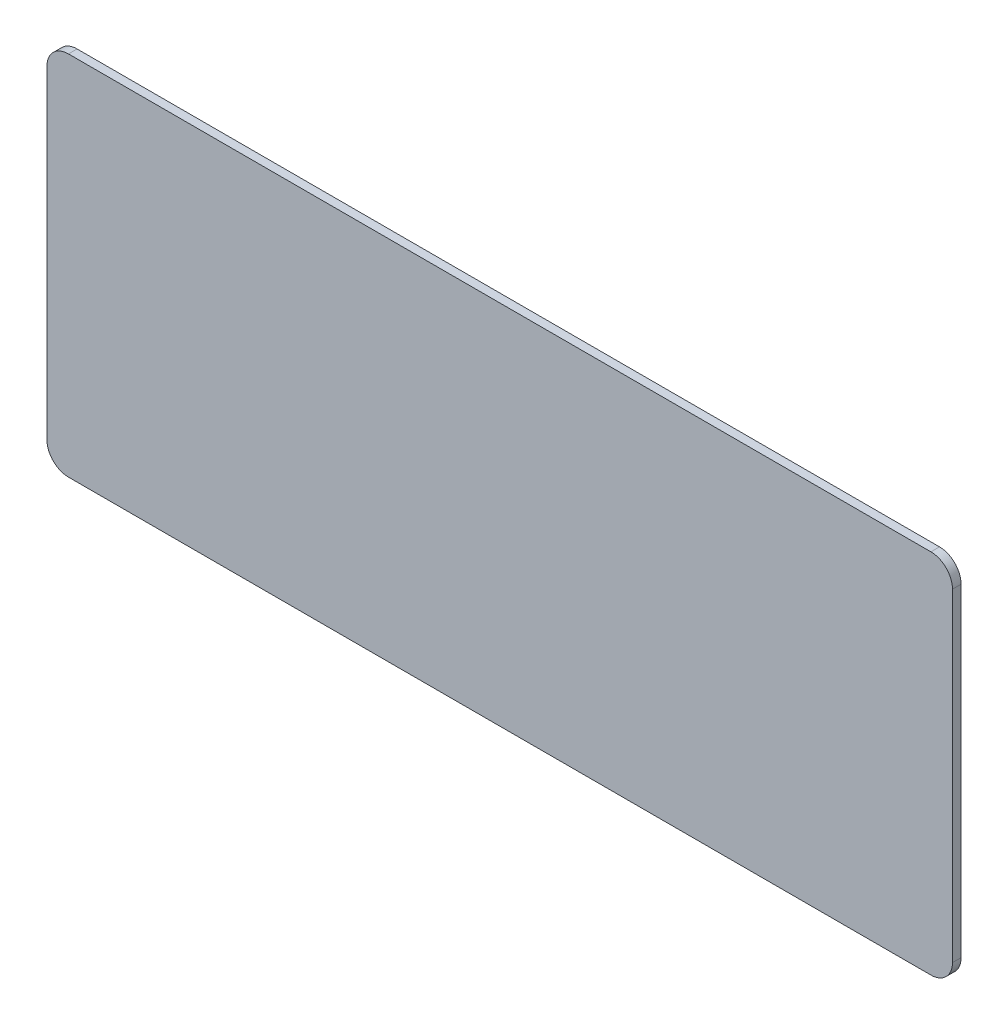
ISO-10303-21;
HEADER;
FILE_DESCRIPTION(('STEP AP214'),'2;1');
FILE_NAME('part.step','',(''),(''),'','','');
FILE_SCHEMA(('AUTOMOTIVE_DESIGN { 1 0 10303 214 1 1 1 1 }'));
ENDSEC;
DATA;
#1=APPLICATION_CONTEXT('core data for automotive mechanical design processes');
#2=APPLICATION_PROTOCOL_DEFINITION('international standard','automotive_design',2000,#1);
#3=PRODUCT_CONTEXT('',#1,'mechanical');
#4=PRODUCT('Part','Part','',(#3));
#5=PRODUCT_RELATED_PRODUCT_CATEGORY('part','',(#4));
#6=PRODUCT_DEFINITION_FORMATION('','',#4);
#7=PRODUCT_DEFINITION_CONTEXT('part definition',#1,'design');
#8=PRODUCT_DEFINITION('design','',#6,#7);
#9=PRODUCT_DEFINITION_SHAPE('','',#8);
#10=(LENGTH_UNIT() NAMED_UNIT(*) SI_UNIT(.MILLI.,.METRE.));
#11=(NAMED_UNIT(*) PLANE_ANGLE_UNIT() SI_UNIT($,.RADIAN.));
#12=(NAMED_UNIT(*) SI_UNIT($,.STERADIAN.) SOLID_ANGLE_UNIT());
#13=UNCERTAINTY_MEASURE_WITH_UNIT(LENGTH_MEASURE(1.E-05),#10,'distance_accuracy_value','');
#14=(GEOMETRIC_REPRESENTATION_CONTEXT(3) GLOBAL_UNCERTAINTY_ASSIGNED_CONTEXT((#13)) GLOBAL_UNIT_ASSIGNED_CONTEXT((#10,
#11,#12)) REPRESENTATION_CONTEXT('',''));
#15=CARTESIAN_POINT('',(0.,0.,0.));
#16=DIRECTION('',(0.,0.,1.));
#17=DIRECTION('',(1.,0.,0.));
#18=AXIS2_PLACEMENT_3D('',#15,#16,#17);
#19=CARTESIAN_POINT('',(0.,-1.38777878078145E-13,0.508000000000008));
#20=DIRECTION('',(1.,0.,0.));
#21=DIRECTION('',(0.,1.,0.));
#22=AXIS2_PLACEMENT_3D('',#19,#20,#21);
#23=PLANE('',#22);
#24=DIRECTION('',(0.,-1.,0.));
#25=VECTOR('',#24,1.);
#26=CARTESIAN_POINT('',(0.,-1.38777878078145E-13,0.508000000000008));
#27=LINE('',#26,#25);
#28=CARTESIAN_POINT('',(0.,20.32,0.508000000000008));
#29=VERTEX_POINT('',#28);
#30=CARTESIAN_POINT('',(0.,1.26999999999983,0.508000000000036));
#31=VERTEX_POINT('',#30);
#32=EDGE_CURVE('E140',#29,#31,#27,.T.);
#33=ORIENTED_EDGE('',*,*,#32,.F.);
#34=DIRECTION('',(0.,0.,-1.));
#35=VECTOR('',#34,1.);
#36=CARTESIAN_POINT('',(0.,20.32,0.508000000000008));
#37=LINE('',#36,#35);
#38=CARTESIAN_POINT('',(0.,20.32,0.));
#39=VERTEX_POINT('',#38);
#40=EDGE_CURVE('E124',#29,#39,#37,.T.);
#41=ORIENTED_EDGE('',*,*,#40,.T.);
#42=DIRECTION('',(0.,-1.,0.));
#43=VECTOR('',#42,1.);
#44=CARTESIAN_POINT('',(0.,-1.66533453693773E-13,0.));
#45=LINE('',#44,#43);
#46=CARTESIAN_POINT('',(0.,1.26999999999983,0.));
#47=VERTEX_POINT('',#46);
#48=EDGE_CURVE('E137',#39,#47,#45,.T.);
#49=ORIENTED_EDGE('',*,*,#48,.T.);
#50=DIRECTION('',(0.,0.,-1.));
#51=VECTOR('',#50,1.);
#52=CARTESIAN_POINT('',(0.,1.26999999999983,0.508000000000036));
#53=LINE('',#52,#51);
#54=EDGE_CURVE('E143',#47,#31,#53,.F.);
#55=ORIENTED_EDGE('',*,*,#54,.T.);
#56=EDGE_LOOP('',(#33,#41,#49,#55));
#57=FACE_BOUND('',#56,.T.);
#58=ADVANCED_FACE('F43',(#57),#23,.F.);
#59=CARTESIAN_POINT('',(0.,-1.38777878078145E-13,0.508000000000008));
#60=DIRECTION('',(0.,1.,0.));
#61=DIRECTION('',(0.,0.,1.));
#62=AXIS2_PLACEMENT_3D('',#59,#60,#61);
#63=PLANE('',#62);
#64=DIRECTION('',(1.,0.,0.));
#65=VECTOR('',#64,1.);
#66=CARTESIAN_POINT('',(0.,-1.66533453693773E-13,0.));
#67=LINE('',#66,#65);
#68=CARTESIAN_POINT('',(1.27,-1.66533453693773E-13,0.));
#69=VERTEX_POINT('',#68);
#70=CARTESIAN_POINT('',(52.07,-1.66533453693773E-13,0.));
#71=VERTEX_POINT('',#70);
#72=EDGE_CURVE('E148',#69,#71,#67,.T.);
#73=ORIENTED_EDGE('',*,*,#72,.T.);
#74=DIRECTION('',(0.,0.,-1.));
#75=VECTOR('',#74,1.);
#76=CARTESIAN_POINT('',(52.07,0.,0.507999999999995));
#77=LINE('',#76,#75);
#78=CARTESIAN_POINT('',(52.07,0.,0.507999999999995));
#79=VERTEX_POINT('',#78);
#80=EDGE_CURVE('E11',#71,#79,#77,.F.);
#81=ORIENTED_EDGE('',*,*,#80,.T.);
#82=DIRECTION('',(1.,0.,0.));
#83=VECTOR('',#82,1.);
#84=CARTESIAN_POINT('',(0.,-1.38777878078145E-13,0.508000000000008));
#85=LINE('',#84,#83);
#86=CARTESIAN_POINT('',(1.27,0.,0.508000000000008));
#87=VERTEX_POINT('',#86);
#88=EDGE_CURVE('E195',#87,#79,#85,.T.);
#89=ORIENTED_EDGE('',*,*,#88,.F.);
#90=DIRECTION('',(0.,0.,-1.));
#91=VECTOR('',#90,1.);
#92=CARTESIAN_POINT('',(1.27,0.,0.508000000000008));
#93=LINE('',#92,#91);
#94=EDGE_CURVE('E52',#87,#69,#93,.T.);
#95=ORIENTED_EDGE('',*,*,#94,.T.);
#96=EDGE_LOOP('',(#73,#81,#89,#95));
#97=FACE_BOUND('',#96,.T.);
#98=ADVANCED_FACE('F193',(#97),#63,.F.);
#99=CARTESIAN_POINT('',(53.34,0.,0.507999999999995));
#100=DIRECTION('',(-1.,0.,0.));
#101=DIRECTION('',(0.,0.,1.));
#102=AXIS2_PLACEMENT_3D('',#99,#100,#101);
#103=PLANE('',#102);
#104=DIRECTION('',(0.,1.,0.));
#105=VECTOR('',#104,1.);
#106=CARTESIAN_POINT('',(53.34,-1.66533453693773E-13,0.));
#107=LINE('',#106,#105);
#108=CARTESIAN_POINT('',(53.34,1.26999999999983,0.));
#109=VERTEX_POINT('',#108);
#110=CARTESIAN_POINT('',(53.34,20.32,0.));
#111=VERTEX_POINT('',#110);
#112=EDGE_CURVE('E154',#109,#111,#107,.T.);
#113=ORIENTED_EDGE('',*,*,#112,.T.);
#114=DIRECTION('',(0.,0.,-1.));
#115=VECTOR('',#114,1.);
#116=CARTESIAN_POINT('',(53.34,20.32,0.507999999999995));
#117=LINE('',#116,#115);
#118=CARTESIAN_POINT('',(53.34,20.32,0.507999999999995));
#119=VERTEX_POINT('',#118);
#120=EDGE_CURVE('E59',#111,#119,#117,.F.);
#121=ORIENTED_EDGE('',*,*,#120,.T.);
#122=DIRECTION('',(0.,1.,0.));
#123=VECTOR('',#122,1.);
#124=CARTESIAN_POINT('',(53.34,0.,0.507999999999995));
#125=LINE('',#124,#123);
#126=CARTESIAN_POINT('',(53.34,1.26999999999983,0.508000000000008));
#127=VERTEX_POINT('',#126);
#128=EDGE_CURVE('E203',#127,#119,#125,.T.);
#129=ORIENTED_EDGE('',*,*,#128,.F.);
#130=DIRECTION('',(0.,0.,-1.));
#131=VECTOR('',#130,1.);
#132=CARTESIAN_POINT('',(53.34,1.26999999999983,0.508000000000008));
#133=LINE('',#132,#131);
#134=EDGE_CURVE('E185',#127,#109,#133,.T.);
#135=ORIENTED_EDGE('',*,*,#134,.T.);
#136=EDGE_LOOP('',(#113,#121,#129,#135));
#137=FACE_BOUND('',#136,.T.);
#138=ADVANCED_FACE('F202',(#137),#103,.F.);
#139=CARTESIAN_POINT('',(0.,21.59,0.507999999999995));
#140=DIRECTION('',(0.,-1.,0.));
#141=DIRECTION('',(0.,0.,-1.));
#142=AXIS2_PLACEMENT_3D('',#139,#140,#141);
#143=PLANE('',#142);
#144=DIRECTION('',(-1.,0.,0.));
#145=VECTOR('',#144,1.);
#146=CARTESIAN_POINT('',(0.,21.59,0.));
#147=LINE('',#146,#145);
#148=CARTESIAN_POINT('',(52.07,21.59,0.));
#149=VERTEX_POINT('',#148);
#150=CARTESIAN_POINT('',(1.27000000000001,21.59,0.));
#151=VERTEX_POINT('',#150);
#152=EDGE_CURVE('E162',#149,#151,#147,.T.);
#153=ORIENTED_EDGE('',*,*,#152,.T.);
#154=DIRECTION('',(0.,0.,-1.));
#155=VECTOR('',#154,1.);
#156=CARTESIAN_POINT('',(1.27000000000001,21.59,0.507999999999995));
#157=LINE('',#156,#155);
#158=CARTESIAN_POINT('',(1.27000000000001,21.59,0.507999999999995));
#159=VERTEX_POINT('',#158);
#160=EDGE_CURVE('E125',#151,#159,#157,.F.);
#161=ORIENTED_EDGE('',*,*,#160,.T.);
#162=DIRECTION('',(-1.,0.,0.));
#163=VECTOR('',#162,1.);
#164=CARTESIAN_POINT('',(0.,21.59,0.507999999999995));
#165=LINE('',#164,#163);
#166=CARTESIAN_POINT('',(52.07,21.59,0.507999999999995));
#167=VERTEX_POINT('',#166);
#168=EDGE_CURVE('E157',#167,#159,#165,.T.);
#169=ORIENTED_EDGE('',*,*,#168,.F.);
#170=DIRECTION('',(0.,0.,-1.));
#171=VECTOR('',#170,1.);
#172=CARTESIAN_POINT('',(52.07,21.59,0.507999999999995));
#173=LINE('',#172,#171);
#174=EDGE_CURVE('E131',#167,#149,#173,.T.);
#175=ORIENTED_EDGE('',*,*,#174,.T.);
#176=EDGE_LOOP('',(#153,#161,#169,#175));
#177=FACE_BOUND('',#176,.T.);
#178=ADVANCED_FACE('F235',(#177),#143,.F.);
#179=CARTESIAN_POINT('',(0.,21.59,0.507999999999995));
#180=DIRECTION('',(0.,0.,-1.));
#181=DIRECTION('',(-1.,0.,0.));
#182=AXIS2_PLACEMENT_3D('',#179,#180,#181);
#183=PLANE('',#182);
#184=ORIENTED_EDGE('',*,*,#168,.T.);
#185=CARTESIAN_POINT('',(1.27000000000001,20.32,0.508000000000008));
#186=DIRECTION('',(0.,0.,-1.));
#187=DIRECTION('',(-1.,0.,0.));
#188=AXIS2_PLACEMENT_3D('',#185,#186,#187);
#189=CIRCLE('',#188,1.27);
#190=EDGE_CURVE('E183',#159,#29,#189,.F.);
#191=ORIENTED_EDGE('',*,*,#190,.T.);
#192=ORIENTED_EDGE('',*,*,#32,.T.);
#193=CARTESIAN_POINT('',(1.27,1.26999999999983,0.508000000000008));
#194=DIRECTION('',(0.,0.,-1.));
#195=DIRECTION('',(-1.,0.,0.));
#196=AXIS2_PLACEMENT_3D('',#193,#194,#195);
#197=CIRCLE('',#196,1.27);
#198=EDGE_CURVE('E176',#31,#87,#197,.F.);
#199=ORIENTED_EDGE('',*,*,#198,.T.);
#200=ORIENTED_EDGE('',*,*,#88,.T.);
#201=CARTESIAN_POINT('',(52.07,1.26999999999983,0.508000000000008));
#202=DIRECTION('',(0.,0.,-1.));
#203=DIRECTION('',(-1.,0.,0.));
#204=AXIS2_PLACEMENT_3D('',#201,#202,#203);
#205=CIRCLE('',#204,1.27);
#206=EDGE_CURVE('E66',#79,#127,#205,.F.);
#207=ORIENTED_EDGE('',*,*,#206,.T.);
#208=ORIENTED_EDGE('',*,*,#128,.T.);
#209=CARTESIAN_POINT('',(52.07,20.32,0.507999999999995));
#210=DIRECTION('',(0.,0.,-1.));
#211=DIRECTION('',(-1.,0.,0.));
#212=AXIS2_PLACEMENT_3D('',#209,#210,#211);
#213=CIRCLE('',#212,1.27);
#214=EDGE_CURVE('E181',#119,#167,#213,.F.);
#215=ORIENTED_EDGE('',*,*,#214,.T.);
#216=EDGE_LOOP('',(#184,#191,#192,#199,#200,#207,#208,#215));
#217=FACE_BOUND('',#216,.T.);
#218=ADVANCED_FACE('F212',(#217),#183,.F.);
#219=CARTESIAN_POINT('',(0.,21.59,0.));
#220=DIRECTION('',(0.,0.,-1.));
#221=DIRECTION('',(-1.,0.,0.));
#222=AXIS2_PLACEMENT_3D('',#219,#220,#221);
#223=PLANE('',#222);
#224=ORIENTED_EDGE('',*,*,#48,.F.);
#225=CARTESIAN_POINT('',(1.27000000000001,20.32,0.));
#226=DIRECTION('',(0.,0.,-1.));
#227=DIRECTION('',(-1.,0.,0.));
#228=AXIS2_PLACEMENT_3D('',#225,#226,#227);
#229=CIRCLE('',#228,1.27);
#230=EDGE_CURVE('E120',#39,#151,#229,.T.);
#231=ORIENTED_EDGE('',*,*,#230,.T.);
#232=ORIENTED_EDGE('',*,*,#152,.F.);
#233=CARTESIAN_POINT('',(52.07,20.32,0.));
#234=DIRECTION('',(0.,0.,-1.));
#235=DIRECTION('',(-1.,0.,0.));
#236=AXIS2_PLACEMENT_3D('',#233,#234,#235);
#237=CIRCLE('',#236,1.27);
#238=EDGE_CURVE('E132',#149,#111,#237,.T.);
#239=ORIENTED_EDGE('',*,*,#238,.T.);
#240=ORIENTED_EDGE('',*,*,#112,.F.);
#241=CARTESIAN_POINT('',(52.07,1.26999999999983,0.));
#242=DIRECTION('',(0.,0.,-1.));
#243=DIRECTION('',(-1.,0.,0.));
#244=AXIS2_PLACEMENT_3D('',#241,#242,#243);
#245=CIRCLE('',#244,1.27);
#246=EDGE_CURVE('E168',#109,#71,#245,.T.);
#247=ORIENTED_EDGE('',*,*,#246,.T.);
#248=ORIENTED_EDGE('',*,*,#72,.F.);
#249=CARTESIAN_POINT('',(1.27,1.26999999999983,0.));
#250=DIRECTION('',(0.,0.,-1.));
#251=DIRECTION('',(-1.,0.,0.));
#252=AXIS2_PLACEMENT_3D('',#249,#250,#251);
#253=CIRCLE('',#252,1.27);
#254=EDGE_CURVE('E142',#69,#47,#253,.T.);
#255=ORIENTED_EDGE('',*,*,#254,.T.);
#256=EDGE_LOOP('',(#224,#231,#232,#239,#240,#247,#248,#255));
#257=FACE_BOUND('',#256,.T.);
#258=ADVANCED_FACE('F145',(#257),#223,.T.);
#259=CARTESIAN_POINT('',(1.27000000000001,20.32,0.508000000000008));
#260=DIRECTION('',(0.,0.,-1.));
#261=DIRECTION('',(-1.,0.,0.));
#262=AXIS2_PLACEMENT_3D('',#259,#260,#261);
#263=CYLINDRICAL_SURFACE('',#262,1.27);
#264=ORIENTED_EDGE('',*,*,#190,.F.);
#265=ORIENTED_EDGE('',*,*,#160,.F.);
#266=ORIENTED_EDGE('',*,*,#230,.F.);
#267=ORIENTED_EDGE('',*,*,#40,.F.);
#268=EDGE_LOOP('',(#264,#265,#266,#267));
#269=FACE_BOUND('',#268,.T.);
#270=ADVANCED_FACE('F123',(#269),#263,.T.);
#271=CARTESIAN_POINT('',(52.07,20.32,0.507999999999995));
#272=DIRECTION('',(0.,0.,-1.));
#273=DIRECTION('',(-1.,0.,0.));
#274=AXIS2_PLACEMENT_3D('',#271,#272,#273);
#275=CYLINDRICAL_SURFACE('',#274,1.27);
#276=ORIENTED_EDGE('',*,*,#214,.F.);
#277=ORIENTED_EDGE('',*,*,#120,.F.);
#278=ORIENTED_EDGE('',*,*,#238,.F.);
#279=ORIENTED_EDGE('',*,*,#174,.F.);
#280=EDGE_LOOP('',(#276,#277,#278,#279));
#281=FACE_BOUND('',#280,.T.);
#282=ADVANCED_FACE('F217',(#281),#275,.T.);
#283=CARTESIAN_POINT('',(52.07,1.26999999999983,0.508000000000008));
#284=DIRECTION('',(0.,0.,-1.));
#285=DIRECTION('',(-1.,0.,0.));
#286=AXIS2_PLACEMENT_3D('',#283,#284,#285);
#287=CYLINDRICAL_SURFACE('',#286,1.27);
#288=ORIENTED_EDGE('',*,*,#206,.F.);
#289=ORIENTED_EDGE('',*,*,#80,.F.);
#290=ORIENTED_EDGE('',*,*,#246,.F.);
#291=ORIENTED_EDGE('',*,*,#134,.F.);
#292=EDGE_LOOP('',(#288,#289,#290,#291));
#293=FACE_BOUND('',#292,.T.);
#294=ADVANCED_FACE('F201',(#293),#287,.T.);
#295=CARTESIAN_POINT('',(1.27,1.26999999999983,0.508000000000008));
#296=DIRECTION('',(0.,0.,-1.));
#297=DIRECTION('',(-1.,0.,0.));
#298=AXIS2_PLACEMENT_3D('',#295,#296,#297);
#299=CYLINDRICAL_SURFACE('',#298,1.27);
#300=ORIENTED_EDGE('',*,*,#198,.F.);
#301=ORIENTED_EDGE('',*,*,#54,.F.);
#302=ORIENTED_EDGE('',*,*,#254,.F.);
#303=ORIENTED_EDGE('',*,*,#94,.F.);
#304=EDGE_LOOP('',(#300,#301,#302,#303));
#305=FACE_BOUND('',#304,.T.);
#306=ADVANCED_FACE('F45',(#305),#299,.T.);
#307=CLOSED_SHELL('',(#58,#98,#138,#178,#218,#258,#270,#282,#294,#306));
#308=MANIFOLD_SOLID_BREP('B2',#307);
#309=ADVANCED_BREP_SHAPE_REPRESENTATION('',(#18,#308),#14);
#310=SHAPE_DEFINITION_REPRESENTATION(#9,#309);
ENDSEC;
END-ISO-10303-21;
